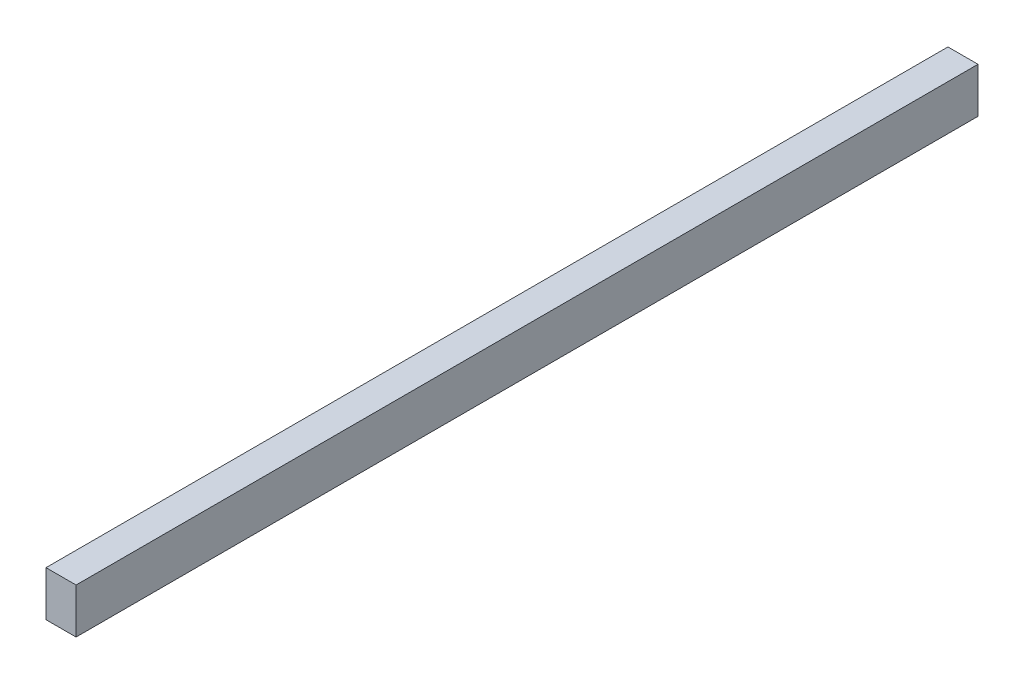
ISO-10303-21;
HEADER;
FILE_DESCRIPTION(('STEP AP214'),'2;1');
FILE_NAME('part.step','',(''),(''),'','','');
FILE_SCHEMA(('AUTOMOTIVE_DESIGN { 1 0 10303 214 1 1 1 1 }'));
ENDSEC;
DATA;
#1=APPLICATION_CONTEXT('core data for automotive mechanical design processes');
#2=APPLICATION_PROTOCOL_DEFINITION('international standard','automotive_design',2000,#1);
#3=PRODUCT_CONTEXT('',#1,'mechanical');
#4=PRODUCT('Part','Part','',(#3));
#5=PRODUCT_RELATED_PRODUCT_CATEGORY('part','',(#4));
#6=PRODUCT_DEFINITION_FORMATION('','',#4);
#7=PRODUCT_DEFINITION_CONTEXT('part definition',#1,'design');
#8=PRODUCT_DEFINITION('design','',#6,#7);
#9=PRODUCT_DEFINITION_SHAPE('','',#8);
#10=(LENGTH_UNIT() NAMED_UNIT(*) SI_UNIT(.MILLI.,.METRE.));
#11=(NAMED_UNIT(*) PLANE_ANGLE_UNIT() SI_UNIT($,.RADIAN.));
#12=(NAMED_UNIT(*) SI_UNIT($,.STERADIAN.) SOLID_ANGLE_UNIT());
#13=UNCERTAINTY_MEASURE_WITH_UNIT(LENGTH_MEASURE(1.E-05),#10,'distance_accuracy_value','');
#14=(GEOMETRIC_REPRESENTATION_CONTEXT(3) GLOBAL_UNCERTAINTY_ASSIGNED_CONTEXT((#13)) GLOBAL_UNIT_ASSIGNED_CONTEXT((#10,
#11,#12)) REPRESENTATION_CONTEXT('',''));
#15=CARTESIAN_POINT('',(0.,0.,0.));
#16=DIRECTION('',(0.,0.,1.));
#17=DIRECTION('',(1.,0.,0.));
#18=AXIS2_PLACEMENT_3D('',#15,#16,#17);
#19=CARTESIAN_POINT('',(0.,0.,300.));
#20=DIRECTION('',(1.,0.,0.));
#21=DIRECTION('',(0.,1.,0.));
#22=AXIS2_PLACEMENT_3D('',#19,#20,#21);
#23=PLANE('',#22);
#24=DIRECTION('',(0.,-1.,0.));
#25=VECTOR('',#24,1.);
#26=CARTESIAN_POINT('',(0.,0.,0.));
#27=LINE('',#26,#25);
#28=CARTESIAN_POINT('',(0.,15.,0.));
#29=VERTEX_POINT('',#28);
#30=CARTESIAN_POINT('',(0.,0.,0.));
#31=VERTEX_POINT('',#30);
#32=EDGE_CURVE('E104',#29,#31,#27,.T.);
#33=ORIENTED_EDGE('',*,*,#32,.T.);
#34=DIRECTION('',(0.,0.,-1.));
#35=VECTOR('',#34,1.);
#36=CARTESIAN_POINT('',(0.,0.,300.));
#37=LINE('',#36,#35);
#38=CARTESIAN_POINT('',(0.,0.,300.));
#39=VERTEX_POINT('',#38);
#40=EDGE_CURVE('E11',#39,#31,#37,.T.);
#41=ORIENTED_EDGE('',*,*,#40,.F.);
#42=DIRECTION('',(0.,-1.,0.));
#43=VECTOR('',#42,1.);
#44=CARTESIAN_POINT('',(0.,0.,300.));
#45=LINE('',#44,#43);
#46=CARTESIAN_POINT('',(0.,15.,300.));
#47=VERTEX_POINT('',#46);
#48=EDGE_CURVE('E92',#47,#39,#45,.T.);
#49=ORIENTED_EDGE('',*,*,#48,.F.);
#50=DIRECTION('',(0.,0.,-1.));
#51=VECTOR('',#50,1.);
#52=CARTESIAN_POINT('',(0.,15.,300.));
#53=LINE('',#52,#51);
#54=EDGE_CURVE('E100',#47,#29,#53,.T.);
#55=ORIENTED_EDGE('',*,*,#54,.T.);
#56=EDGE_LOOP('',(#33,#41,#49,#55));
#57=FACE_BOUND('',#56,.T.);
#58=ADVANCED_FACE('F41',(#57),#23,.F.);
#59=CARTESIAN_POINT('',(0.,0.,300.));
#60=DIRECTION('',(0.,1.,0.));
#61=DIRECTION('',(0.,0.,1.));
#62=AXIS2_PLACEMENT_3D('',#59,#60,#61);
#63=PLANE('',#62);
#64=DIRECTION('',(1.,0.,0.));
#65=VECTOR('',#64,1.);
#66=CARTESIAN_POINT('',(0.,0.,0.));
#67=LINE('',#66,#65);
#68=CARTESIAN_POINT('',(10.,0.,0.));
#69=VERTEX_POINT('',#68);
#70=EDGE_CURVE('E96',#31,#69,#67,.T.);
#71=ORIENTED_EDGE('',*,*,#70,.T.);
#72=DIRECTION('',(0.,0.,-1.));
#73=VECTOR('',#72,1.);
#74=CARTESIAN_POINT('',(10.,0.,300.));
#75=LINE('',#74,#73);
#76=CARTESIAN_POINT('',(10.,0.,300.));
#77=VERTEX_POINT('',#76);
#78=EDGE_CURVE('E49',#77,#69,#75,.T.);
#79=ORIENTED_EDGE('',*,*,#78,.F.);
#80=DIRECTION('',(1.,0.,0.));
#81=VECTOR('',#80,1.);
#82=CARTESIAN_POINT('',(0.,0.,300.));
#83=LINE('',#82,#81);
#84=EDGE_CURVE('E87',#39,#77,#83,.T.);
#85=ORIENTED_EDGE('',*,*,#84,.F.);
#86=ORIENTED_EDGE('',*,*,#40,.T.);
#87=EDGE_LOOP('',(#71,#79,#85,#86));
#88=FACE_BOUND('',#87,.T.);
#89=ADVANCED_FACE('F95',(#88),#63,.F.);
#90=CARTESIAN_POINT('',(10.,0.,300.));
#91=DIRECTION('',(-1.,0.,0.));
#92=DIRECTION('',(0.,-1.,0.));
#93=AXIS2_PLACEMENT_3D('',#90,#91,#92);
#94=PLANE('',#93);
#95=DIRECTION('',(0.,1.,0.));
#96=VECTOR('',#95,1.);
#97=CARTESIAN_POINT('',(10.,0.,0.));
#98=LINE('',#97,#96);
#99=CARTESIAN_POINT('',(10.,15.,0.));
#100=VERTEX_POINT('',#99);
#101=EDGE_CURVE('E74',#69,#100,#98,.T.);
#102=ORIENTED_EDGE('',*,*,#101,.T.);
#103=DIRECTION('',(0.,0.,-1.));
#104=VECTOR('',#103,1.);
#105=CARTESIAN_POINT('',(10.,15.,300.));
#106=LINE('',#105,#104);
#107=CARTESIAN_POINT('',(10.,15.,300.));
#108=VERTEX_POINT('',#107);
#109=EDGE_CURVE('E97',#108,#100,#106,.T.);
#110=ORIENTED_EDGE('',*,*,#109,.F.);
#111=DIRECTION('',(0.,1.,0.));
#112=VECTOR('',#111,1.);
#113=CARTESIAN_POINT('',(10.,0.,300.));
#114=LINE('',#113,#112);
#115=EDGE_CURVE('E90',#77,#108,#114,.T.);
#116=ORIENTED_EDGE('',*,*,#115,.F.);
#117=ORIENTED_EDGE('',*,*,#78,.T.);
#118=EDGE_LOOP('',(#102,#110,#116,#117));
#119=FACE_BOUND('',#118,.T.);
#120=ADVANCED_FACE('F98',(#119),#94,.F.);
#121=CARTESIAN_POINT('',(0.,15.,300.));
#122=DIRECTION('',(0.,-1.,0.));
#123=DIRECTION('',(0.,0.,-1.));
#124=AXIS2_PLACEMENT_3D('',#121,#122,#123);
#125=PLANE('',#124);
#126=DIRECTION('',(-1.,0.,0.));
#127=VECTOR('',#126,1.);
#128=CARTESIAN_POINT('',(0.,15.,0.));
#129=LINE('',#128,#127);
#130=EDGE_CURVE('E80',#100,#29,#129,.T.);
#131=ORIENTED_EDGE('',*,*,#130,.T.);
#132=ORIENTED_EDGE('',*,*,#54,.F.);
#133=DIRECTION('',(-1.,0.,0.));
#134=VECTOR('',#133,1.);
#135=CARTESIAN_POINT('',(0.,15.,300.));
#136=LINE('',#135,#134);
#137=EDGE_CURVE('E57',#108,#47,#136,.T.);
#138=ORIENTED_EDGE('',*,*,#137,.F.);
#139=ORIENTED_EDGE('',*,*,#109,.T.);
#140=EDGE_LOOP('',(#131,#132,#138,#139));
#141=FACE_BOUND('',#140,.T.);
#142=ADVANCED_FACE('F111',(#141),#125,.F.);
#143=CARTESIAN_POINT('',(0.,15.,300.));
#144=DIRECTION('',(0.,0.,-1.));
#145=DIRECTION('',(-1.,0.,0.));
#146=AXIS2_PLACEMENT_3D('',#143,#144,#145);
#147=PLANE('',#146);
#148=ORIENTED_EDGE('',*,*,#48,.T.);
#149=ORIENTED_EDGE('',*,*,#84,.T.);
#150=ORIENTED_EDGE('',*,*,#115,.T.);
#151=ORIENTED_EDGE('',*,*,#137,.T.);
#152=EDGE_LOOP('',(#148,#149,#150,#151));
#153=FACE_BOUND('',#152,.T.);
#154=ADVANCED_FACE('F88',(#153),#147,.F.);
#155=CARTESIAN_POINT('',(0.,15.,0.));
#156=DIRECTION('',(0.,0.,-1.));
#157=DIRECTION('',(-1.,0.,0.));
#158=AXIS2_PLACEMENT_3D('',#155,#156,#157);
#159=PLANE('',#158);
#160=ORIENTED_EDGE('',*,*,#32,.F.);
#161=ORIENTED_EDGE('',*,*,#130,.F.);
#162=ORIENTED_EDGE('',*,*,#101,.F.);
#163=ORIENTED_EDGE('',*,*,#70,.F.);
#164=EDGE_LOOP('',(#160,#161,#162,#163));
#165=FACE_BOUND('',#164,.T.);
#166=ADVANCED_FACE('F114',(#165),#159,.T.);
#167=CLOSED_SHELL('',(#58,#89,#120,#142,#154,#166));
#168=MANIFOLD_SOLID_BREP('B2',#167);
#169=ADVANCED_BREP_SHAPE_REPRESENTATION('',(#18,#168),#14);
#170=SHAPE_DEFINITION_REPRESENTATION(#9,#169);
ENDSEC;
END-ISO-10303-21;
